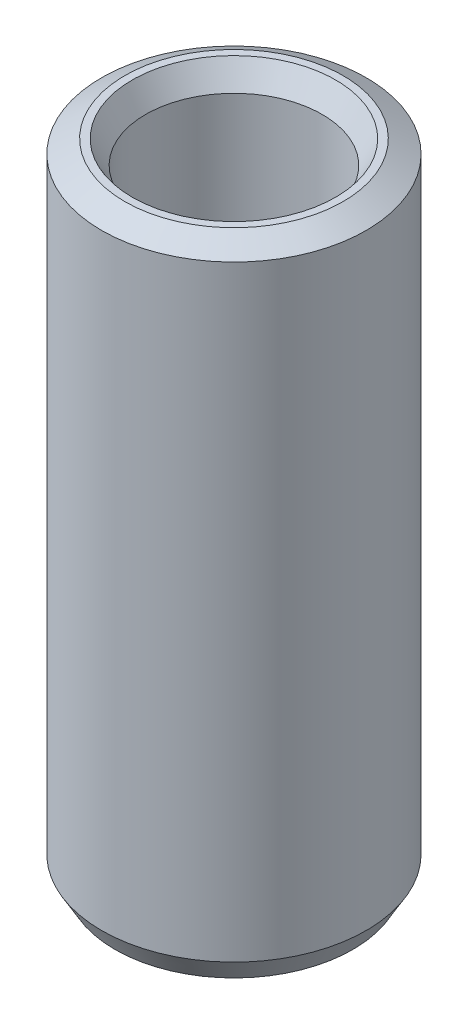
ISO-10303-21;
HEADER;
FILE_DESCRIPTION(('STEP AP214'),'2;1');
FILE_NAME('part.step','',(''),(''),'','','');
FILE_SCHEMA(('AUTOMOTIVE_DESIGN { 1 0 10303 214 1 1 1 1 }'));
ENDSEC;
DATA;
#1=APPLICATION_CONTEXT('core data for automotive mechanical design processes');
#2=APPLICATION_PROTOCOL_DEFINITION('international standard','automotive_design',2000,#1);
#3=PRODUCT_CONTEXT('',#1,'mechanical');
#4=PRODUCT('Part','Part','',(#3));
#5=PRODUCT_RELATED_PRODUCT_CATEGORY('part','',(#4));
#6=PRODUCT_DEFINITION_FORMATION('','',#4);
#7=PRODUCT_DEFINITION_CONTEXT('part definition',#1,'design');
#8=PRODUCT_DEFINITION('design','',#6,#7);
#9=PRODUCT_DEFINITION_SHAPE('','',#8);
#10=(LENGTH_UNIT() NAMED_UNIT(*) SI_UNIT(.MILLI.,.METRE.));
#11=(NAMED_UNIT(*) PLANE_ANGLE_UNIT() SI_UNIT($,.RADIAN.));
#12=(NAMED_UNIT(*) SI_UNIT($,.STERADIAN.) SOLID_ANGLE_UNIT());
#13=UNCERTAINTY_MEASURE_WITH_UNIT(LENGTH_MEASURE(1.E-05),#10,'distance_accuracy_value','');
#14=(GEOMETRIC_REPRESENTATION_CONTEXT(3) GLOBAL_UNCERTAINTY_ASSIGNED_CONTEXT((#13)) GLOBAL_UNIT_ASSIGNED_CONTEXT((#10,
#11,#12)) REPRESENTATION_CONTEXT('',''));
#15=CARTESIAN_POINT('',(0.,0.,0.));
#16=DIRECTION('',(0.,0.,1.));
#17=DIRECTION('',(1.,0.,0.));
#18=AXIS2_PLACEMENT_3D('',#15,#16,#17);
#19=CARTESIAN_POINT('',(0.,109.298146087594,0.));
#20=DIRECTION('',(0.,-1.,0.));
#21=DIRECTION('',(0.,0.,-1.));
#22=AXIS2_PLACEMENT_3D('',#19,#20,#21);
#23=CYLINDRICAL_SURFACE('',#22,22.5);
#24=CARTESIAN_POINT('',(0.,3.93961962747008,0.));
#25=DIRECTION('',(0.,1.,0.));
#26=DIRECTION('',(0.,0.,1.));
#27=AXIS2_PLACEMENT_3D('',#24,#25,#26);
#28=CIRCLE('',#27,22.5);
#29=CARTESIAN_POINT('',(0.,3.93961962747008,22.5));
#30=VERTEX_POINT('',#29);
#31=EDGE_CURVE('E10',#30,#30,#28,.T.);
#32=ORIENTED_EDGE('',*,*,#31,.T.);
#33=EDGE_LOOP('',(#32));
#34=FACE_BOUND('',#33,.T.);
#35=CARTESIAN_POINT('',(0.,107.023605635169,0.));
#36=DIRECTION('',(0.,1.,0.));
#37=DIRECTION('',(0.,0.,1.));
#38=AXIS2_PLACEMENT_3D('',#35,#36,#37);
#39=CIRCLE('',#38,22.5);
#40=CARTESIAN_POINT('',(0.,107.023605635169,22.5));
#41=VERTEX_POINT('',#40);
#42=EDGE_CURVE('E50',#41,#41,#39,.F.);
#43=ORIENTED_EDGE('',*,*,#42,.T.);
#44=EDGE_LOOP('',(#43));
#45=FACE_BOUND('',#44,.T.);
#46=ADVANCED_FACE('F39',(#34,#45),#23,.T.);
#47=CARTESIAN_POINT('',(0.,109.298146087594,0.));
#48=DIRECTION('',(0.,1.,0.));
#49=DIRECTION('',(0.,0.,1.));
#50=AXIS2_PLACEMENT_3D('',#47,#48,#49);
#51=PLANE('',#50);
#52=CARTESIAN_POINT('',(0.,109.298146087594,0.));
#53=DIRECTION('',(0.,1.,0.));
#54=DIRECTION('',(0.,0.,1.));
#55=AXIS2_PLACEMENT_3D('',#52,#53,#54);
#56=CIRCLE('',#55,17.2869742212943);
#57=CARTESIAN_POINT('',(0.,109.298146087594,17.2869742212943));
#58=VERTEX_POINT('',#57);
#59=EDGE_CURVE('E58',#58,#58,#56,.F.);
#60=ORIENTED_EDGE('',*,*,#59,.T.);
#61=EDGE_LOOP('',(#60));
#62=FACE_BOUND('',#61,.T.);
#63=CARTESIAN_POINT('',(0.,109.298146087594,0.));
#64=DIRECTION('',(0.,1.,0.));
#65=DIRECTION('',(0.,0.,1.));
#66=AXIS2_PLACEMENT_3D('',#63,#64,#65);
#67=CIRCLE('',#66,18.5603803725299);
#68=CARTESIAN_POINT('',(0.,109.298146087594,18.5603803725299));
#69=VERTEX_POINT('',#68);
#70=EDGE_CURVE('E61',#69,#69,#67,.T.);
#71=ORIENTED_EDGE('',*,*,#70,.T.);
#72=EDGE_LOOP('',(#71));
#73=FACE_BOUND('',#72,.T.);
#74=ADVANCED_FACE('F88',(#62,#73),#51,.T.);
#75=CARTESIAN_POINT('',(0.,0.,0.));
#76=DIRECTION('',(0.,1.,0.));
#77=DIRECTION('',(0.,0.,1.));
#78=AXIS2_PLACEMENT_3D('',#75,#76,#77);
#79=PLANE('',#78);
#80=CARTESIAN_POINT('',(0.,0.,0.));
#81=DIRECTION('',(0.,1.,0.));
#82=DIRECTION('',(0.,0.,1.));
#83=AXIS2_PLACEMENT_3D('',#80,#81,#82);
#84=CIRCLE('',#83,18.9520533963398);
#85=CARTESIAN_POINT('',(0.,0.,18.9520533963398));
#86=VERTEX_POINT('',#85);
#87=EDGE_CURVE('E51',#86,#86,#84,.T.);
#88=ORIENTED_EDGE('',*,*,#87,.T.);
#89=EDGE_LOOP('',(#88));
#90=FACE_BOUND('',#89,.T.);
#91=CARTESIAN_POINT('',(0.,0.,0.));
#92=DIRECTION('',(0.,1.,0.));
#93=DIRECTION('',(0.,0.,1.));
#94=AXIS2_PLACEMENT_3D('',#91,#92,#93);
#95=CIRCLE('',#94,20.2254595475754);
#96=CARTESIAN_POINT('',(0.,0.,20.2254595475754));
#97=VERTEX_POINT('',#96);
#98=EDGE_CURVE('E54',#97,#97,#95,.F.);
#99=ORIENTED_EDGE('',*,*,#98,.T.);
#100=EDGE_LOOP('',(#99));
#101=FACE_BOUND('',#100,.T.);
#102=ADVANCED_FACE('F83',(#90,#101),#79,.F.);
#103=CARTESIAN_POINT('',(0.,109.298146087594,0.));
#104=DIRECTION('',(0.,-1.,0.));
#105=DIRECTION('',(0.,0.,-1.));
#106=AXIS2_PLACEMENT_3D('',#103,#104,#105);
#107=CYLINDRICAL_SURFACE('',#106,15.0124337688697);
#108=CARTESIAN_POINT('',(0.,105.358526460124,0.));
#109=DIRECTION('',(0.,1.,0.));
#110=DIRECTION('',(0.,0.,1.));
#111=AXIS2_PLACEMENT_3D('',#108,#109,#110);
#112=CIRCLE('',#111,15.0124337688697);
#113=CARTESIAN_POINT('',(0.,105.358526460124,15.0124337688697));
#114=VERTEX_POINT('',#113);
#115=EDGE_CURVE('E67',#114,#114,#112,.T.);
#116=ORIENTED_EDGE('',*,*,#115,.T.);
#117=EDGE_LOOP('',(#116));
#118=FACE_BOUND('',#117,.T.);
#119=CARTESIAN_POINT('',(0.,2.2745404524246,0.));
#120=DIRECTION('',(0.,1.,0.));
#121=DIRECTION('',(0.,0.,1.));
#122=AXIS2_PLACEMENT_3D('',#119,#120,#121);
#123=CIRCLE('',#122,15.0124337688697);
#124=CARTESIAN_POINT('',(0.,2.2745404524246,15.0124337688697));
#125=VERTEX_POINT('',#124);
#126=EDGE_CURVE('E69',#125,#125,#123,.F.);
#127=ORIENTED_EDGE('',*,*,#126,.T.);
#128=EDGE_LOOP('',(#127));
#129=FACE_BOUND('',#128,.T.);
#130=ADVANCED_FACE('F71',(#118,#129),#107,.F.);
#131=CARTESIAN_POINT('',(0.,105.358526460124,0.));
#132=DIRECTION('',(0.,1.,0.));
#133=DIRECTION('',(0.,0.,1.));
#134=AXIS2_PLACEMENT_3D('',#131,#132,#133);
#135=CONICAL_SURFACE('',#134,15.0124337688697,0.523598775598302);
#136=ORIENTED_EDGE('',*,*,#59,.F.);
#137=EDGE_LOOP('',(#136));
#138=FACE_BOUND('',#137,.T.);
#139=ORIENTED_EDGE('',*,*,#115,.F.);
#140=EDGE_LOOP('',(#139));
#141=FACE_BOUND('',#140,.T.);
#142=ADVANCED_FACE('F77',(#138,#141),#135,.F.);
#143=CARTESIAN_POINT('',(0.,0.,0.));
#144=DIRECTION('',(0.,-1.,0.));
#145=DIRECTION('',(0.,0.,-1.));
#146=AXIS2_PLACEMENT_3D('',#143,#144,#145);
#147=CONICAL_SURFACE('',#146,18.9520533963398,1.0471975511966);
#148=ORIENTED_EDGE('',*,*,#126,.F.);
#149=EDGE_LOOP('',(#148));
#150=FACE_BOUND('',#149,.T.);
#151=ORIENTED_EDGE('',*,*,#87,.F.);
#152=EDGE_LOOP('',(#151));
#153=FACE_BOUND('',#152,.T.);
#154=ADVANCED_FACE('F73',(#150,#153),#147,.F.);
#155=CARTESIAN_POINT('',(0.,3.93961962747008,0.));
#156=DIRECTION('',(0.,1.,0.));
#157=DIRECTION('',(0.,0.,1.));
#158=AXIS2_PLACEMENT_3D('',#155,#156,#157);
#159=CONICAL_SURFACE('',#158,22.5,0.523598775598304);
#160=ORIENTED_EDGE('',*,*,#98,.F.);
#161=EDGE_LOOP('',(#160));
#162=FACE_BOUND('',#161,.T.);
#163=ORIENTED_EDGE('',*,*,#31,.F.);
#164=EDGE_LOOP('',(#163));
#165=FACE_BOUND('',#164,.T.);
#166=ADVANCED_FACE('F76',(#162,#165),#159,.T.);
#167=CARTESIAN_POINT('',(0.,109.298146087594,0.));
#168=DIRECTION('',(0.,-1.,0.));
#169=DIRECTION('',(0.,0.,-1.));
#170=AXIS2_PLACEMENT_3D('',#167,#168,#169);
#171=CONICAL_SURFACE('',#170,18.5603803725299,1.04719755119659);
#172=ORIENTED_EDGE('',*,*,#42,.F.);
#173=EDGE_LOOP('',(#172));
#174=FACE_BOUND('',#173,.T.);
#175=ORIENTED_EDGE('',*,*,#70,.F.);
#176=EDGE_LOOP('',(#175));
#177=FACE_BOUND('',#176,.T.);
#178=ADVANCED_FACE('F45',(#174,#177),#171,.T.);
#179=CLOSED_SHELL('',(#46,#74,#102,#130,#142,#154,#166,#178));
#180=MANIFOLD_SOLID_BREP('B2',#179);
#181=ADVANCED_BREP_SHAPE_REPRESENTATION('',(#18,#180),#14);
#182=SHAPE_DEFINITION_REPRESENTATION(#9,#181);
ENDSEC;
END-ISO-10303-21;
